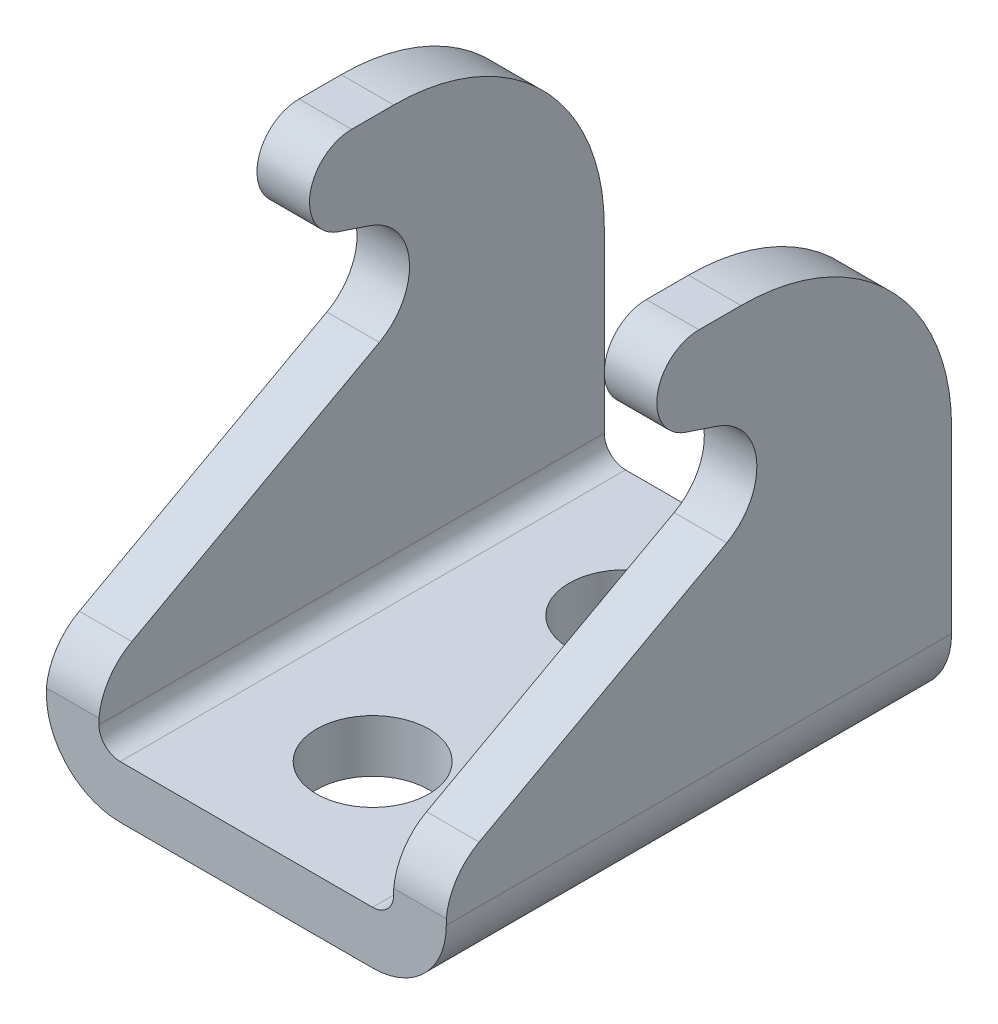
ISO-10303-21;
HEADER;
FILE_DESCRIPTION(('STEP AP214'),'2;1');
FILE_NAME('part.step','',(''),(''),'','','');
FILE_SCHEMA(('AUTOMOTIVE_DESIGN { 1 0 10303 214 1 1 1 1 }'));
ENDSEC;
DATA;
#1=APPLICATION_CONTEXT('core data for automotive mechanical design processes');
#2=APPLICATION_PROTOCOL_DEFINITION('international standard','automotive_design',2000,#1);
#3=PRODUCT_CONTEXT('',#1,'mechanical');
#4=PRODUCT('Part','Part','',(#3));
#5=PRODUCT_RELATED_PRODUCT_CATEGORY('part','',(#4));
#6=PRODUCT_DEFINITION_FORMATION('','',#4);
#7=PRODUCT_DEFINITION_CONTEXT('part definition',#1,'design');
#8=PRODUCT_DEFINITION('design','',#6,#7);
#9=PRODUCT_DEFINITION_SHAPE('','',#8);
#10=(LENGTH_UNIT() NAMED_UNIT(*) SI_UNIT(.MILLI.,.METRE.));
#11=(NAMED_UNIT(*) PLANE_ANGLE_UNIT() SI_UNIT($,.RADIAN.));
#12=(NAMED_UNIT(*) SI_UNIT($,.STERADIAN.) SOLID_ANGLE_UNIT());
#13=UNCERTAINTY_MEASURE_WITH_UNIT(LENGTH_MEASURE(1.E-05),#10,'distance_accuracy_value','');
#14=(GEOMETRIC_REPRESENTATION_CONTEXT(3) GLOBAL_UNCERTAINTY_ASSIGNED_CONTEXT((#13)) GLOBAL_UNIT_ASSIGNED_CONTEXT((#10,
#11,#12)) REPRESENTATION_CONTEXT('',''));
#15=CARTESIAN_POINT('',(0.,0.,0.));
#16=DIRECTION('',(0.,0.,1.));
#17=DIRECTION('',(1.,0.,0.));
#18=AXIS2_PLACEMENT_3D('',#15,#16,#17);
#19=CARTESIAN_POINT('',(15.0749,10.602361807025,83.884239336947));
#20=DIRECTION('',(0.,-0.877525818949163,-0.479529391255219));
#21=DIRECTION('',(0.,0.479529391255219,-0.877525818949163));
#22=AXIS2_PLACEMENT_3D('',#19,#20,#21);
#23=PLANE('',#22);
#24=DIRECTION('',(1.,0.,0.));
#25=VECTOR('',#24,1.);
#26=CARTESIAN_POINT('',(15.0749,20.8042652021749,65.2150319954842));
#27=LINE('',#26,#25);
#28=CARTESIAN_POINT('',(-11.1125,20.8042652021749,65.2150319954842));
#29=VERTEX_POINT('',#28);
#30=CARTESIAN_POINT('',(-15.0749,20.8042652021749,65.2150319954842));
#31=VERTEX_POINT('',#30);
#32=EDGE_CURVE('E211',#29,#31,#27,.F.);
#33=ORIENTED_EDGE('',*,*,#32,.T.);
#34=DIRECTION('',(0.,0.479529391255221,-0.877525818949162));
#35=VECTOR('',#34,1.);
#36=CARTESIAN_POINT('',(-15.0749,10.602361807025,83.884239336947));
#37=LINE('',#36,#35);
#38=CARTESIAN_POINT('',(-15.0749,10.602361807025,83.884239336947));
#39=VERTEX_POINT('',#38);
#40=EDGE_CURVE('E290',#39,#31,#37,.T.);
#41=ORIENTED_EDGE('',*,*,#40,.F.);
#42=DIRECTION('',(1.,0.,0.));
#43=VECTOR('',#42,1.);
#44=CARTESIAN_POINT('',(15.0749,10.602361807025,83.884239336947));
#45=LINE('',#44,#43);
#46=CARTESIAN_POINT('',(-11.1125,10.602361807025,83.884239336947));
#47=VERTEX_POINT('',#46);
#48=EDGE_CURVE('E178',#47,#39,#45,.F.);
#49=ORIENTED_EDGE('',*,*,#48,.F.);
#50=DIRECTION('',(0.,-0.479529391255221,0.877525818949162));
#51=VECTOR('',#50,1.);
#52=CARTESIAN_POINT('',(-11.1125,20.8042652021749,65.2150319954842));
#53=LINE('',#52,#51);
#54=EDGE_CURVE('E298',#29,#47,#53,.T.);
#55=ORIENTED_EDGE('',*,*,#54,.F.);
#56=EDGE_LOOP('',(#33,#41,#49,#55));
#57=FACE_BOUND('',#56,.T.);
#58=ADVANCED_FACE('F16',(#57),#23,.F.);
#59=CARTESIAN_POINT('',(15.0749,24.638,67.31));
#60=DIRECTION('',(1.,0.,0.));
#61=DIRECTION('',(0.,0.,-1.));
#62=AXIS2_PLACEMENT_3D('',#59,#60,#61);
#63=CYLINDRICAL_SURFACE('',#62,4.3688);
#64=DIRECTION('',(1.,0.,0.));
#65=VECTOR('',#64,1.);
#66=CARTESIAN_POINT('',(15.0749,28.7834747603834,65.9310683660803));
#67=LINE('',#66,#65);
#68=CARTESIAN_POINT('',(-11.1125,28.7834747603834,65.9310683660803));
#69=VERTEX_POINT('',#68);
#70=CARTESIAN_POINT('',(-15.0749,28.7834747603834,65.9310683660803));
#71=VERTEX_POINT('',#70);
#72=EDGE_CURVE('E164',#69,#71,#67,.F.);
#73=ORIENTED_EDGE('',*,*,#72,.T.);
#74=CARTESIAN_POINT('',(-15.0749,24.638,67.31));
#75=DIRECTION('',(1.,0.,0.));
#76=DIRECTION('',(0.,0.,-1.));
#77=AXIS2_PLACEMENT_3D('',#74,#75,#76);
#78=CIRCLE('',#77,4.3688);
#79=EDGE_CURVE('E287',#31,#71,#78,.T.);
#80=ORIENTED_EDGE('',*,*,#79,.F.);
#81=ORIENTED_EDGE('',*,*,#32,.F.);
#82=CARTESIAN_POINT('',(-11.1125,24.638,67.31));
#83=DIRECTION('',(1.,0.,0.));
#84=DIRECTION('',(0.,0.,-1.));
#85=AXIS2_PLACEMENT_3D('',#82,#83,#84);
#86=CIRCLE('',#85,4.3688);
#87=EDGE_CURVE('E172',#69,#29,#86,.F.);
#88=ORIENTED_EDGE('',*,*,#87,.F.);
#89=EDGE_LOOP('',(#73,#80,#81,#88));
#90=FACE_BOUND('',#89,.T.);
#91=ADVANCED_FACE('F668',(#90),#63,.F.);
#92=CARTESIAN_POINT('',(15.0749,28.7834747603834,65.9310683660803));
#93=DIRECTION('',(0.,0.94888178913738,-0.315631668632037));
#94=DIRECTION('',(0.,0.315631668632037,0.94888178913738));
#95=AXIS2_PLACEMENT_3D('',#92,#93,#94);
#96=PLANE('',#95);
#97=DIRECTION('',(1.,0.,0.));
#98=VECTOR('',#97,1.);
#99=CARTESIAN_POINT('',(15.0749,29.5755003194888,68.3121305479067));
#100=LINE('',#99,#98);
#101=CARTESIAN_POINT('',(-15.0749,29.5755003194888,68.3121305479067));
#102=VERTEX_POINT('',#101);
#103=CARTESIAN_POINT('',(-11.1125,29.5755003194888,68.3121305479067));
#104=VERTEX_POINT('',#103);
#105=EDGE_CURVE('E154',#102,#104,#100,.T.);
#106=ORIENTED_EDGE('',*,*,#105,.F.);
#107=DIRECTION('',(0.,0.315631668632024,0.948881789137385));
#108=VECTOR('',#107,1.);
#109=CARTESIAN_POINT('',(-15.0749,28.7834747603834,65.9310683660803));
#110=LINE('',#109,#108);
#111=EDGE_CURVE('E286',#71,#102,#110,.T.);
#112=ORIENTED_EDGE('',*,*,#111,.F.);
#113=ORIENTED_EDGE('',*,*,#72,.F.);
#114=DIRECTION('',(0.,-0.315631668632024,-0.948881789137385));
#115=VECTOR('',#114,1.);
#116=CARTESIAN_POINT('',(-11.1125,29.5755003194888,68.3121305479067));
#117=LINE('',#116,#115);
#118=EDGE_CURVE('E167',#104,#69,#117,.T.);
#119=ORIENTED_EDGE('',*,*,#118,.F.);
#120=EDGE_LOOP('',(#106,#112,#113,#119));
#121=FACE_BOUND('',#120,.T.);
#122=ADVANCED_FACE('F168',(#121),#96,.F.);
#123=CARTESIAN_POINT('',(15.0749,32.5882,67.31));
#124=DIRECTION('',(1.,0.,0.));
#125=DIRECTION('',(0.,0.,-1.));
#126=AXIS2_PLACEMENT_3D('',#123,#124,#125);
#127=CYLINDRICAL_SURFACE('',#126,3.175);
#128=CARTESIAN_POINT('',(-15.0749,32.5882,67.31));
#129=DIRECTION('',(1.,0.,0.));
#130=DIRECTION('',(0.,0.,-1.));
#131=AXIS2_PLACEMENT_3D('',#128,#129,#130);
#132=CIRCLE('',#131,3.175);
#133=CARTESIAN_POINT('',(-15.0749,35.7632,67.31));
#134=VERTEX_POINT('',#133);
#135=EDGE_CURVE('E160',#102,#134,#132,.F.);
#136=ORIENTED_EDGE('',*,*,#135,.F.);
#137=ORIENTED_EDGE('',*,*,#105,.T.);
#138=CARTESIAN_POINT('',(-11.1125,32.5882,67.31));
#139=DIRECTION('',(1.,0.,0.));
#140=DIRECTION('',(0.,0.,-1.));
#141=AXIS2_PLACEMENT_3D('',#138,#139,#140);
#142=CIRCLE('',#141,3.175);
#143=CARTESIAN_POINT('',(-11.1125,35.7632,67.31));
#144=VERTEX_POINT('',#143);
#145=EDGE_CURVE('E19',#144,#104,#142,.T.);
#146=ORIENTED_EDGE('',*,*,#145,.F.);
#147=DIRECTION('',(1.,0.,0.));
#148=VECTOR('',#147,1.);
#149=CARTESIAN_POINT('',(-11.1125,35.7632,67.31));
#150=LINE('',#149,#148);
#151=EDGE_CURVE('E149',#134,#144,#150,.T.);
#152=ORIENTED_EDGE('',*,*,#151,.F.);
#153=EDGE_LOOP('',(#136,#137,#146,#152));
#154=FACE_BOUND('',#153,.T.);
#155=ADVANCED_FACE('F156',(#154),#127,.T.);
#156=CARTESIAN_POINT('',(-11.1125,35.7632,86.36));
#157=DIRECTION('',(0.,1.,0.));
#158=DIRECTION('',(0.,0.,1.));
#159=AXIS2_PLACEMENT_3D('',#156,#157,#158);
#160=PLANE('',#159);
#161=ORIENTED_EDGE('',*,*,#151,.T.);
#162=DIRECTION('',(0.,0.,-1.));
#163=VECTOR('',#162,1.);
#164=CARTESIAN_POINT('',(-11.1125,35.7632,86.36));
#165=LINE('',#164,#163);
#166=CARTESIAN_POINT('',(-11.1125,35.7632,64.135));
#167=VERTEX_POINT('',#166);
#168=EDGE_CURVE('E177',#167,#144,#165,.F.);
#169=ORIENTED_EDGE('',*,*,#168,.F.);
#170=DIRECTION('',(1.,0.,0.));
#171=VECTOR('',#170,1.);
#172=CARTESIAN_POINT('',(15.0749,35.7632,64.135));
#173=LINE('',#172,#171);
#174=CARTESIAN_POINT('',(-15.0749,35.7632,64.135));
#175=VERTEX_POINT('',#174);
#176=EDGE_CURVE('E213',#175,#167,#173,.T.);
#177=ORIENTED_EDGE('',*,*,#176,.F.);
#178=DIRECTION('',(0.,0.,1.));
#179=VECTOR('',#178,1.);
#180=CARTESIAN_POINT('',(-15.0749,35.7632,86.36));
#181=LINE('',#180,#179);
#182=EDGE_CURVE('E285',#134,#175,#181,.F.);
#183=ORIENTED_EDGE('',*,*,#182,.F.);
#184=EDGE_LOOP('',(#161,#169,#177,#183));
#185=FACE_BOUND('',#184,.T.);
#186=ADVANCED_FACE('F643',(#185),#160,.T.);
#187=CARTESIAN_POINT('',(15.0749,6.39445,81.5848));
#188=DIRECTION('',(1.,0.,0.));
#189=DIRECTION('',(0.,0.,-1.));
#190=AXIS2_PLACEMENT_3D('',#187,#188,#189);
#191=CYLINDRICAL_SURFACE('',#190,4.79519999999999);
#192=CARTESIAN_POINT('',(-15.0749,6.39445,81.5848));
#193=DIRECTION('',(1.,0.,0.));
#194=DIRECTION('',(0.,0.,-1.));
#195=AXIS2_PLACEMENT_3D('',#192,#193,#194);
#196=CIRCLE('',#195,4.79519999999999);
#197=CARTESIAN_POINT('',(-15.0749,6.83195199999533,86.36));
#198=VERTEX_POINT('',#197);
#199=EDGE_CURVE('E291',#198,#39,#196,.F.);
#200=ORIENTED_EDGE('',*,*,#199,.F.);
#201=DIRECTION('',(1.,0.,0.));
#202=VECTOR('',#201,1.);
#203=CARTESIAN_POINT('',(0.,6.83195199999543,86.36));
#204=LINE('',#203,#202);
#205=CARTESIAN_POINT('',(-11.1125,6.83195199999533,86.36));
#206=VERTEX_POINT('',#205);
#207=EDGE_CURVE('E204',#206,#198,#204,.F.);
#208=ORIENTED_EDGE('',*,*,#207,.F.);
#209=CARTESIAN_POINT('',(-11.1125,6.39445,81.5848));
#210=DIRECTION('',(1.,0.,0.));
#211=DIRECTION('',(0.,0.,-1.));
#212=AXIS2_PLACEMENT_3D('',#209,#210,#211);
#213=CIRCLE('',#212,4.79519999999999);
#214=EDGE_CURVE('E186',#47,#206,#213,.T.);
#215=ORIENTED_EDGE('',*,*,#214,.F.);
#216=ORIENTED_EDGE('',*,*,#48,.T.);
#217=EDGE_LOOP('',(#200,#208,#215,#216));
#218=FACE_BOUND('',#217,.T.);
#219=ADVANCED_FACE('F407',(#218),#191,.T.);
#220=CARTESIAN_POINT('',(0.,0.838199999999993,57.785));
#221=DIRECTION('',(0.,-1.,0.));
#222=DIRECTION('',(0.,0.,-1.));
#223=AXIS2_PLACEMENT_3D('',#220,#221,#222);
#224=CYLINDRICAL_SURFACE('',#223,4.2418);
#225=CARTESIAN_POINT('',(0.,4.8006,57.785));
#226=DIRECTION('',(0.,-1.,0.));
#227=DIRECTION('',(0.,0.,-1.));
#228=AXIS2_PLACEMENT_3D('',#225,#226,#227);
#229=CIRCLE('',#228,4.2418);
#230=CARTESIAN_POINT('',(0.,4.8006,53.5432));
#231=VERTEX_POINT('',#230);
#232=EDGE_CURVE('E262',#231,#231,#229,.T.);
#233=ORIENTED_EDGE('',*,*,#232,.F.);
#234=EDGE_LOOP('',(#233));
#235=FACE_BOUND('',#234,.T.);
#236=CARTESIAN_POINT('',(0.,0.838199999999993,57.785));
#237=DIRECTION('',(0.,-1.,0.));
#238=DIRECTION('',(0.,0.,-1.));
#239=AXIS2_PLACEMENT_3D('',#236,#237,#238);
#240=CIRCLE('',#239,4.2418);
#241=CARTESIAN_POINT('',(0.,0.838199999999993,53.5432));
#242=VERTEX_POINT('',#241);
#243=EDGE_CURVE('E280',#242,#242,#240,.F.);
#244=ORIENTED_EDGE('',*,*,#243,.F.);
#245=EDGE_LOOP('',(#244));
#246=FACE_BOUND('',#245,.T.);
#247=ADVANCED_FACE('F624',(#235,#246),#224,.F.);
#248=CARTESIAN_POINT('',(0.,0.838199999999993,76.835));
#249=DIRECTION('',(0.,-1.,0.));
#250=DIRECTION('',(0.,0.,-1.));
#251=AXIS2_PLACEMENT_3D('',#248,#249,#250);
#252=CYLINDRICAL_SURFACE('',#251,4.2418);
#253=CARTESIAN_POINT('',(0.,4.8006,76.835));
#254=DIRECTION('',(0.,-1.,0.));
#255=DIRECTION('',(0.,0.,-1.));
#256=AXIS2_PLACEMENT_3D('',#253,#254,#255);
#257=CIRCLE('',#256,4.2418);
#258=CARTESIAN_POINT('',(0.,4.8006,72.5932));
#259=VERTEX_POINT('',#258);
#260=EDGE_CURVE('E191',#259,#259,#257,.T.);
#261=ORIENTED_EDGE('',*,*,#260,.F.);
#262=EDGE_LOOP('',(#261));
#263=FACE_BOUND('',#262,.T.);
#264=CARTESIAN_POINT('',(0.,0.838199999999993,76.835));
#265=DIRECTION('',(0.,-1.,0.));
#266=DIRECTION('',(0.,0.,-1.));
#267=AXIS2_PLACEMENT_3D('',#264,#265,#266);
#268=CIRCLE('',#267,4.2418);
#269=CARTESIAN_POINT('',(0.,0.838199999999993,72.5932));
#270=VERTEX_POINT('',#269);
#271=EDGE_CURVE('E276',#270,#270,#268,.F.);
#272=ORIENTED_EDGE('',*,*,#271,.F.);
#273=EDGE_LOOP('',(#272));
#274=FACE_BOUND('',#273,.T.);
#275=ADVANCED_FACE('F615',(#263,#274),#252,.F.);
#276=CARTESIAN_POINT('',(-9.5123,6.4008,86.36));
#277=DIRECTION('',(0.,0.,1.));
#278=DIRECTION('',(1.,0.,0.));
#279=AXIS2_PLACEMENT_3D('',#276,#277,#278);
#280=CYLINDRICAL_SURFACE('',#279,1.6002);
#281=DIRECTION('',(0.,0.,-1.));
#282=VECTOR('',#281,1.);
#283=CARTESIAN_POINT('',(-11.1125,6.40079999999999,86.36));
#284=LINE('',#283,#282);
#285=CARTESIAN_POINT('',(-11.1125,6.40079999999999,86.36));
#286=VERTEX_POINT('',#285);
#287=CARTESIAN_POINT('',(-11.1125,6.40079999999999,48.26));
#288=VERTEX_POINT('',#287);
#289=EDGE_CURVE('E183',#286,#288,#284,.T.);
#290=ORIENTED_EDGE('',*,*,#289,.F.);
#291=CARTESIAN_POINT('',(-9.5123,6.4008,86.36));
#292=DIRECTION('',(0.,0.,1.));
#293=DIRECTION('',(1.,0.,0.));
#294=AXIS2_PLACEMENT_3D('',#291,#292,#293);
#295=CIRCLE('',#294,1.6002);
#296=CARTESIAN_POINT('',(-9.5123,4.8006,86.36));
#297=VERTEX_POINT('',#296);
#298=EDGE_CURVE('E273',#297,#286,#295,.F.);
#299=ORIENTED_EDGE('',*,*,#298,.F.);
#300=DIRECTION('',(0.,0.,1.));
#301=VECTOR('',#300,1.);
#302=CARTESIAN_POINT('',(-9.5123,4.8006,86.36));
#303=LINE('',#302,#301);
#304=CARTESIAN_POINT('',(-9.5123,4.8006,48.26));
#305=VERTEX_POINT('',#304);
#306=EDGE_CURVE('E187',#305,#297,#303,.T.);
#307=ORIENTED_EDGE('',*,*,#306,.F.);
#308=CARTESIAN_POINT('',(-9.5123,6.4008,48.26));
#309=DIRECTION('',(0.,0.,1.));
#310=DIRECTION('',(1.,0.,0.));
#311=AXIS2_PLACEMENT_3D('',#308,#309,#310);
#312=CIRCLE('',#311,1.6002);
#313=EDGE_CURVE('E245',#305,#288,#312,.F.);
#314=ORIENTED_EDGE('',*,*,#313,.T.);
#315=EDGE_LOOP('',(#290,#299,#307,#314));
#316=FACE_BOUND('',#315,.T.);
#317=ADVANCED_FACE('F401',(#316),#280,.F.);
#318=CARTESIAN_POINT('',(-11.1125,6.40079999999999,86.36));
#319=DIRECTION('',(1.,0.,0.));
#320=DIRECTION('',(0.,0.,-1.));
#321=AXIS2_PLACEMENT_3D('',#318,#319,#320);
#322=PLANE('',#321);
#323=ORIENTED_EDGE('',*,*,#289,.T.);
#324=DIRECTION('',(0.,1.,0.));
#325=VECTOR('',#324,1.);
#326=CARTESIAN_POINT('',(-11.1125,0.838199999999993,48.26));
#327=LINE('',#326,#325);
#328=CARTESIAN_POINT('',(-11.1125,19.8882,48.26));
#329=VERTEX_POINT('',#328);
#330=EDGE_CURVE('E247',#288,#329,#327,.T.);
#331=ORIENTED_EDGE('',*,*,#330,.T.);
#332=CARTESIAN_POINT('',(-11.1125,19.8882,64.135));
#333=DIRECTION('',(1.,0.,0.));
#334=DIRECTION('',(0.,0.,-1.));
#335=AXIS2_PLACEMENT_3D('',#332,#333,#334);
#336=CIRCLE('',#335,15.875);
#337=EDGE_CURVE('E185',#167,#329,#336,.F.);
#338=ORIENTED_EDGE('',*,*,#337,.F.);
#339=ORIENTED_EDGE('',*,*,#168,.T.);
#340=ORIENTED_EDGE('',*,*,#145,.T.);
#341=ORIENTED_EDGE('',*,*,#118,.T.);
#342=ORIENTED_EDGE('',*,*,#87,.T.);
#343=ORIENTED_EDGE('',*,*,#54,.T.);
#344=ORIENTED_EDGE('',*,*,#214,.T.);
#345=DIRECTION('',(0.,1.,0.));
#346=VECTOR('',#345,1.);
#347=CARTESIAN_POINT('',(-11.1125,0.838199999999993,86.36));
#348=LINE('',#347,#346);
#349=EDGE_CURVE('E208',#286,#206,#348,.T.);
#350=ORIENTED_EDGE('',*,*,#349,.F.);
#351=EDGE_LOOP('',(#323,#331,#338,#339,#340,#341,#342,#343,#344,#350));
#352=FACE_BOUND('',#351,.T.);
#353=ADVANCED_FACE('F175',(#352),#322,.T.);
#354=CARTESIAN_POINT('',(15.0749,19.8882,64.135));
#355=DIRECTION('',(1.,0.,0.));
#356=DIRECTION('',(0.,0.,-1.));
#357=AXIS2_PLACEMENT_3D('',#354,#355,#356);
#358=CYLINDRICAL_SURFACE('',#357,15.875);
#359=CARTESIAN_POINT('',(-15.0749,19.8882,64.135));
#360=DIRECTION('',(1.,0.,0.));
#361=DIRECTION('',(0.,0.,-1.));
#362=AXIS2_PLACEMENT_3D('',#359,#360,#361);
#363=CIRCLE('',#362,15.875);
#364=CARTESIAN_POINT('',(-15.0749,19.8882,48.26));
#365=VERTEX_POINT('',#364);
#366=EDGE_CURVE('E216',#175,#365,#363,.F.);
#367=ORIENTED_EDGE('',*,*,#366,.F.);
#368=ORIENTED_EDGE('',*,*,#176,.T.);
#369=ORIENTED_EDGE('',*,*,#337,.T.);
#370=DIRECTION('',(1.,0.,0.));
#371=VECTOR('',#370,1.);
#372=CARTESIAN_POINT('',(0.,19.8882,48.26));
#373=LINE('',#372,#371);
#374=EDGE_CURVE('E302',#329,#365,#373,.F.);
#375=ORIENTED_EDGE('',*,*,#374,.T.);
#376=EDGE_LOOP('',(#367,#368,#369,#375));
#377=FACE_BOUND('',#376,.T.);
#378=ADVANCED_FACE('F589',(#377),#358,.T.);
#379=CARTESIAN_POINT('',(-15.0749,35.7632,86.36));
#380=DIRECTION('',(-1.,0.,0.));
#381=DIRECTION('',(0.,0.,1.));
#382=AXIS2_PLACEMENT_3D('',#379,#380,#381);
#383=PLANE('',#382);
#384=ORIENTED_EDGE('',*,*,#135,.T.);
#385=ORIENTED_EDGE('',*,*,#182,.T.);
#386=ORIENTED_EDGE('',*,*,#366,.T.);
#387=DIRECTION('',(0.,1.,0.));
#388=VECTOR('',#387,1.);
#389=CARTESIAN_POINT('',(-15.0749,0.838199999999993,48.26));
#390=LINE('',#389,#388);
#391=CARTESIAN_POINT('',(-15.0749,6.4008,48.26));
#392=VERTEX_POINT('',#391);
#393=EDGE_CURVE('E244',#365,#392,#390,.F.);
#394=ORIENTED_EDGE('',*,*,#393,.T.);
#395=DIRECTION('',(0.,0.,1.));
#396=VECTOR('',#395,1.);
#397=CARTESIAN_POINT('',(-15.0749,6.4008,86.36));
#398=LINE('',#397,#396);
#399=CARTESIAN_POINT('',(-15.0749,6.4008,86.36));
#400=VERTEX_POINT('',#399);
#401=EDGE_CURVE('E283',#400,#392,#398,.F.);
#402=ORIENTED_EDGE('',*,*,#401,.F.);
#403=DIRECTION('',(0.,1.,0.));
#404=VECTOR('',#403,1.);
#405=CARTESIAN_POINT('',(-15.0749,0.838199999999993,86.36));
#406=LINE('',#405,#404);
#407=EDGE_CURVE('E207',#198,#400,#406,.F.);
#408=ORIENTED_EDGE('',*,*,#407,.F.);
#409=ORIENTED_EDGE('',*,*,#199,.T.);
#410=ORIENTED_EDGE('',*,*,#40,.T.);
#411=ORIENTED_EDGE('',*,*,#79,.T.);
#412=ORIENTED_EDGE('',*,*,#111,.T.);
#413=EDGE_LOOP('',(#384,#385,#386,#394,#402,#408,#409,#410,#411,#412));
#414=FACE_BOUND('',#413,.T.);
#415=ADVANCED_FACE('F410',(#414),#383,.T.);
#416=CARTESIAN_POINT('',(-9.5123,6.4008,86.36));
#417=DIRECTION('',(0.,0.,1.));
#418=DIRECTION('',(1.,0.,0.));
#419=AXIS2_PLACEMENT_3D('',#416,#417,#418);
#420=CYLINDRICAL_SURFACE('',#419,5.56260000000001);
#421=CARTESIAN_POINT('',(-9.5123,6.4008,86.36));
#422=DIRECTION('',(0.,0.,1.));
#423=DIRECTION('',(1.,0.,0.));
#424=AXIS2_PLACEMENT_3D('',#421,#422,#423);
#425=CIRCLE('',#424,5.56260000000001);
#426=CARTESIAN_POINT('',(-9.51230000000001,0.838199999999993,86.36));
#427=VERTEX_POINT('',#426);
#428=EDGE_CURVE('E270',#400,#427,#425,.T.);
#429=ORIENTED_EDGE('',*,*,#428,.F.);
#430=ORIENTED_EDGE('',*,*,#401,.T.);
#431=CARTESIAN_POINT('',(-9.5123,6.4008,48.26));
#432=DIRECTION('',(0.,0.,1.));
#433=DIRECTION('',(1.,0.,0.));
#434=AXIS2_PLACEMENT_3D('',#431,#432,#433);
#435=CIRCLE('',#434,5.56260000000001);
#436=CARTESIAN_POINT('',(-9.51230000000001,0.838199999999993,48.26));
#437=VERTEX_POINT('',#436);
#438=EDGE_CURVE('E242',#392,#437,#435,.T.);
#439=ORIENTED_EDGE('',*,*,#438,.T.);
#440=DIRECTION('',(0.,0.,-1.));
#441=VECTOR('',#440,1.);
#442=CARTESIAN_POINT('',(-9.51230000000001,0.838199999999993,86.36));
#443=LINE('',#442,#441);
#444=EDGE_CURVE('E279',#427,#437,#443,.T.);
#445=ORIENTED_EDGE('',*,*,#444,.F.);
#446=EDGE_LOOP('',(#429,#430,#439,#445));
#447=FACE_BOUND('',#446,.T.);
#448=ADVANCED_FACE('F415',(#447),#420,.T.);
#449=CARTESIAN_POINT('',(-9.51230000000001,0.838199999999993,86.36));
#450=DIRECTION('',(0.,-1.,0.));
#451=DIRECTION('',(0.,0.,-1.));
#452=AXIS2_PLACEMENT_3D('',#449,#450,#451);
#453=PLANE('',#452);
#454=DIRECTION('',(1.,0.,0.));
#455=VECTOR('',#454,1.);
#456=CARTESIAN_POINT('',(0.,0.838199999999993,86.36));
#457=LINE('',#456,#455);
#458=CARTESIAN_POINT('',(9.51229999999999,0.838199999999991,86.36));
#459=VERTEX_POINT('',#458);
#460=EDGE_CURVE('E269',#427,#459,#457,.T.);
#461=ORIENTED_EDGE('',*,*,#460,.F.);
#462=ORIENTED_EDGE('',*,*,#444,.T.);
#463=DIRECTION('',(1.,0.,0.));
#464=VECTOR('',#463,1.);
#465=CARTESIAN_POINT('',(0.,0.838199999999993,48.26));
#466=LINE('',#465,#464);
#467=CARTESIAN_POINT('',(9.51229999999999,0.838199999999991,48.26));
#468=VERTEX_POINT('',#467);
#469=EDGE_CURVE('E241',#437,#468,#466,.T.);
#470=ORIENTED_EDGE('',*,*,#469,.T.);
#471=DIRECTION('',(0.,0.,1.));
#472=VECTOR('',#471,1.);
#473=CARTESIAN_POINT('',(9.5123,0.83819999999999,86.36));
#474=LINE('',#473,#472);
#475=EDGE_CURVE('E313',#459,#468,#474,.F.);
#476=ORIENTED_EDGE('',*,*,#475,.F.);
#477=EDGE_LOOP('',(#461,#462,#470,#476));
#478=FACE_BOUND('',#477,.T.);
#479=ORIENTED_EDGE('',*,*,#271,.T.);
#480=EDGE_LOOP('',(#479));
#481=FACE_BOUND('',#480,.T.);
#482=ORIENTED_EDGE('',*,*,#243,.T.);
#483=EDGE_LOOP('',(#482));
#484=FACE_BOUND('',#483,.T.);
#485=ADVANCED_FACE('F419',(#478,#481,#484),#453,.T.);
#486=CARTESIAN_POINT('',(9.51229999999999,6.40079999999999,86.36));
#487=DIRECTION('',(0.,0.,1.));
#488=DIRECTION('',(1.,0.,0.));
#489=AXIS2_PLACEMENT_3D('',#486,#487,#488);
#490=CYLINDRICAL_SURFACE('',#489,5.5626);
#491=CARTESIAN_POINT('',(9.51229999999999,6.40079999999999,86.36));
#492=DIRECTION('',(0.,0.,1.));
#493=DIRECTION('',(1.,0.,0.));
#494=AXIS2_PLACEMENT_3D('',#491,#492,#493);
#495=CIRCLE('',#494,5.5626);
#496=CARTESIAN_POINT('',(15.0749,6.40079999999999,86.36));
#497=VERTEX_POINT('',#496);
#498=EDGE_CURVE('E266',#459,#497,#495,.T.);
#499=ORIENTED_EDGE('',*,*,#498,.F.);
#500=ORIENTED_EDGE('',*,*,#475,.T.);
#501=CARTESIAN_POINT('',(9.51229999999999,6.40079999999999,48.26));
#502=DIRECTION('',(0.,0.,1.));
#503=DIRECTION('',(1.,0.,0.));
#504=AXIS2_PLACEMENT_3D('',#501,#502,#503);
#505=CIRCLE('',#504,5.5626);
#506=CARTESIAN_POINT('',(15.0749,6.40079999999999,48.26));
#507=VERTEX_POINT('',#506);
#508=EDGE_CURVE('E238',#468,#507,#505,.T.);
#509=ORIENTED_EDGE('',*,*,#508,.T.);
#510=DIRECTION('',(0.,0.,-1.));
#511=VECTOR('',#510,1.);
#512=CARTESIAN_POINT('',(15.0749,6.40079999999999,86.36));
#513=LINE('',#512,#511);
#514=EDGE_CURVE('E316',#497,#507,#513,.T.);
#515=ORIENTED_EDGE('',*,*,#514,.F.);
#516=EDGE_LOOP('',(#499,#500,#509,#515));
#517=FACE_BOUND('',#516,.T.);
#518=ADVANCED_FACE('F424',(#517),#490,.T.);
#519=CARTESIAN_POINT('',(15.0749,6.40079999999999,86.36));
#520=DIRECTION('',(1.,0.,0.));
#521=DIRECTION('',(0.,0.,-1.));
#522=AXIS2_PLACEMENT_3D('',#519,#520,#521);
#523=PLANE('',#522);
#524=CARTESIAN_POINT('',(15.0749,24.638,67.31));
#525=DIRECTION('',(1.,0.,0.));
#526=DIRECTION('',(0.,0.,-1.));
#527=AXIS2_PLACEMENT_3D('',#524,#525,#526);
#528=CIRCLE('',#527,4.3688);
#529=CARTESIAN_POINT('',(15.0749,28.7834747603834,65.9310683660803));
#530=VERTEX_POINT('',#529);
#531=CARTESIAN_POINT('',(15.0749,20.8042652021749,65.2150319954842));
#532=VERTEX_POINT('',#531);
#533=EDGE_CURVE('E255',#530,#532,#528,.F.);
#534=ORIENTED_EDGE('',*,*,#533,.T.);
#535=DIRECTION('',(0.,0.479529391255219,-0.877525818949163));
#536=VECTOR('',#535,1.);
#537=CARTESIAN_POINT('',(15.0749,10.602361807025,83.884239336947));
#538=LINE('',#537,#536);
#539=CARTESIAN_POINT('',(15.0749,10.602361807025,83.884239336947));
#540=VERTEX_POINT('',#539);
#541=EDGE_CURVE('E200',#532,#540,#538,.F.);
#542=ORIENTED_EDGE('',*,*,#541,.T.);
#543=CARTESIAN_POINT('',(15.0749,6.39445,81.5848));
#544=DIRECTION('',(1.,0.,0.));
#545=DIRECTION('',(0.,0.,-1.));
#546=AXIS2_PLACEMENT_3D('',#543,#544,#545);
#547=CIRCLE('',#546,4.79519999999999);
#548=CARTESIAN_POINT('',(15.0749,6.83195199999533,86.36));
#549=VERTEX_POINT('',#548);
#550=EDGE_CURVE('E203',#549,#540,#547,.F.);
#551=ORIENTED_EDGE('',*,*,#550,.F.);
#552=DIRECTION('',(0.,1.,0.));
#553=VECTOR('',#552,1.);
#554=CARTESIAN_POINT('',(15.0749,0.838199999999993,86.36));
#555=LINE('',#554,#553);
#556=EDGE_CURVE('E265',#497,#549,#555,.T.);
#557=ORIENTED_EDGE('',*,*,#556,.F.);
#558=ORIENTED_EDGE('',*,*,#514,.T.);
#559=DIRECTION('',(0.,1.,0.));
#560=VECTOR('',#559,1.);
#561=CARTESIAN_POINT('',(15.0749,0.838199999999993,48.26));
#562=LINE('',#561,#560);
#563=CARTESIAN_POINT('',(15.0749,19.8882,48.26));
#564=VERTEX_POINT('',#563);
#565=EDGE_CURVE('E240',#507,#564,#562,.T.);
#566=ORIENTED_EDGE('',*,*,#565,.T.);
#567=CARTESIAN_POINT('',(15.0749,19.8882,64.135));
#568=DIRECTION('',(1.,0.,0.));
#569=DIRECTION('',(0.,0.,-1.));
#570=AXIS2_PLACEMENT_3D('',#567,#568,#569);
#571=CIRCLE('',#570,15.875);
#572=CARTESIAN_POINT('',(15.0749,35.7632,64.135));
#573=VERTEX_POINT('',#572);
#574=EDGE_CURVE('E249',#573,#564,#571,.F.);
#575=ORIENTED_EDGE('',*,*,#574,.F.);
#576=DIRECTION('',(0.,0.,1.));
#577=VECTOR('',#576,1.);
#578=CARTESIAN_POINT('',(15.0749,35.7632,86.36));
#579=LINE('',#578,#577);
#580=CARTESIAN_POINT('',(15.0749,35.7632,67.31));
#581=VERTEX_POINT('',#580);
#582=EDGE_CURVE('E192',#581,#573,#579,.F.);
#583=ORIENTED_EDGE('',*,*,#582,.F.);
#584=CARTESIAN_POINT('',(15.0749,32.5882,67.31));
#585=DIRECTION('',(1.,0.,0.));
#586=DIRECTION('',(0.,0.,-1.));
#587=AXIS2_PLACEMENT_3D('',#584,#585,#586);
#588=CIRCLE('',#587,3.175);
#589=CARTESIAN_POINT('',(15.0749,29.5755003194888,68.3121305479067));
#590=VERTEX_POINT('',#589);
#591=EDGE_CURVE('E252',#590,#581,#588,.F.);
#592=ORIENTED_EDGE('',*,*,#591,.F.);
#593=DIRECTION('',(0.,0.315631668632037,0.94888178913738));
#594=VECTOR('',#593,1.);
#595=CARTESIAN_POINT('',(15.0749,28.7834747603834,65.9310683660803));
#596=LINE('',#595,#594);
#597=EDGE_CURVE('E196',#590,#530,#596,.F.);
#598=ORIENTED_EDGE('',*,*,#597,.T.);
#599=EDGE_LOOP('',(#534,#542,#551,#557,#558,#566,#575,#583,#592,#598));
#600=FACE_BOUND('',#599,.T.);
#601=ADVANCED_FACE('F428',(#600),#523,.T.);
#602=CARTESIAN_POINT('',(0.,0.838199999999993,86.36));
#603=DIRECTION('',(0.,0.,1.));
#604=DIRECTION('',(1.,0.,0.));
#605=AXIS2_PLACEMENT_3D('',#602,#603,#604);
#606=PLANE('',#605);
#607=ORIENTED_EDGE('',*,*,#498,.T.);
#608=ORIENTED_EDGE('',*,*,#556,.T.);
#609=DIRECTION('',(1.,0.,0.));
#610=VECTOR('',#609,1.);
#611=CARTESIAN_POINT('',(15.0749,6.83195199999543,86.36));
#612=LINE('',#611,#610);
#613=CARTESIAN_POINT('',(11.1125,6.83195199999533,86.36));
#614=VERTEX_POINT('',#613);
#615=EDGE_CURVE('E259',#614,#549,#612,.T.);
#616=ORIENTED_EDGE('',*,*,#615,.F.);
#617=DIRECTION('',(0.,1.,0.));
#618=VECTOR('',#617,1.);
#619=CARTESIAN_POINT('',(11.1125,0.838199999999993,86.36));
#620=LINE('',#619,#618);
#621=CARTESIAN_POINT('',(11.1125,6.40079999999999,86.36));
#622=VERTEX_POINT('',#621);
#623=EDGE_CURVE('E34',#614,#622,#620,.F.);
#624=ORIENTED_EDGE('',*,*,#623,.T.);
#625=CARTESIAN_POINT('',(9.5123,6.40079999999999,86.36));
#626=DIRECTION('',(0.,0.,1.));
#627=DIRECTION('',(1.,0.,0.));
#628=AXIS2_PLACEMENT_3D('',#625,#626,#627);
#629=CIRCLE('',#628,1.6002);
#630=CARTESIAN_POINT('',(9.5123,4.80059999999999,86.36));
#631=VERTEX_POINT('',#630);
#632=EDGE_CURVE('E235',#622,#631,#629,.F.);
#633=ORIENTED_EDGE('',*,*,#632,.T.);
#634=DIRECTION('',(1.,0.,0.));
#635=VECTOR('',#634,1.);
#636=CARTESIAN_POINT('',(9.5123,4.8006,86.36));
#637=LINE('',#636,#635);
#638=EDGE_CURVE('E190',#297,#631,#637,.T.);
#639=ORIENTED_EDGE('',*,*,#638,.F.);
#640=ORIENTED_EDGE('',*,*,#298,.T.);
#641=ORIENTED_EDGE('',*,*,#349,.T.);
#642=ORIENTED_EDGE('',*,*,#207,.T.);
#643=ORIENTED_EDGE('',*,*,#407,.T.);
#644=ORIENTED_EDGE('',*,*,#428,.T.);
#645=ORIENTED_EDGE('',*,*,#460,.T.);
#646=EDGE_LOOP('',(#607,#608,#616,#624,#633,#639,#640,#641,#642,#643,#644,#645));
#647=FACE_BOUND('',#646,.T.);
#648=ADVANCED_FACE('F399',(#647),#606,.T.);
#649=CARTESIAN_POINT('',(9.5123,4.8006,86.36));
#650=DIRECTION('',(0.,1.,0.));
#651=DIRECTION('',(0.,0.,1.));
#652=AXIS2_PLACEMENT_3D('',#649,#650,#651);
#653=PLANE('',#652);
#654=ORIENTED_EDGE('',*,*,#638,.T.);
#655=DIRECTION('',(0.,0.,1.));
#656=VECTOR('',#655,1.);
#657=CARTESIAN_POINT('',(9.5123,4.80059999999999,86.36));
#658=LINE('',#657,#656);
#659=CARTESIAN_POINT('',(9.5123,4.80059999999999,48.26));
#660=VERTEX_POINT('',#659);
#661=EDGE_CURVE('E234',#631,#660,#658,.F.);
#662=ORIENTED_EDGE('',*,*,#661,.T.);
#663=DIRECTION('',(1.,0.,0.));
#664=VECTOR('',#663,1.);
#665=CARTESIAN_POINT('',(0.,4.8006,48.26));
#666=LINE('',#665,#664);
#667=EDGE_CURVE('E248',#660,#305,#666,.F.);
#668=ORIENTED_EDGE('',*,*,#667,.T.);
#669=ORIENTED_EDGE('',*,*,#306,.T.);
#670=EDGE_LOOP('',(#654,#662,#668,#669));
#671=FACE_BOUND('',#670,.T.);
#672=ORIENTED_EDGE('',*,*,#260,.T.);
#673=EDGE_LOOP('',(#672));
#674=FACE_BOUND('',#673,.T.);
#675=ORIENTED_EDGE('',*,*,#232,.T.);
#676=EDGE_LOOP('',(#675));
#677=FACE_BOUND('',#676,.T.);
#678=ADVANCED_FACE('F392',(#671,#674,#677),#653,.T.);
#679=CARTESIAN_POINT('',(15.0749,6.39445,81.5848));
#680=DIRECTION('',(1.,0.,0.));
#681=DIRECTION('',(0.,0.,-1.));
#682=AXIS2_PLACEMENT_3D('',#679,#680,#681);
#683=CYLINDRICAL_SURFACE('',#682,4.79519999999999);
#684=ORIENTED_EDGE('',*,*,#550,.T.);
#685=DIRECTION('',(1.,0.,0.));
#686=VECTOR('',#685,1.);
#687=CARTESIAN_POINT('',(15.0749,10.602361807025,83.884239336947));
#688=LINE('',#687,#686);
#689=CARTESIAN_POINT('',(11.1125,10.602361807025,83.884239336947));
#690=VERTEX_POINT('',#689);
#691=EDGE_CURVE('E202',#540,#690,#688,.F.);
#692=ORIENTED_EDGE('',*,*,#691,.T.);
#693=CARTESIAN_POINT('',(11.1125,6.39445,81.5848));
#694=DIRECTION('',(1.,0.,0.));
#695=DIRECTION('',(0.,0.,-1.));
#696=AXIS2_PLACEMENT_3D('',#693,#694,#695);
#697=CIRCLE('',#696,4.79519999999999);
#698=EDGE_CURVE('E229',#614,#690,#697,.F.);
#699=ORIENTED_EDGE('',*,*,#698,.F.);
#700=ORIENTED_EDGE('',*,*,#615,.T.);
#701=EDGE_LOOP('',(#684,#692,#699,#700));
#702=FACE_BOUND('',#701,.T.);
#703=ADVANCED_FACE('F431',(#702),#683,.T.);
#704=CARTESIAN_POINT('',(15.0749,10.602361807025,83.884239336947));
#705=DIRECTION('',(0.,-0.877525818949163,-0.479529391255219));
#706=DIRECTION('',(0.,0.479529391255219,-0.877525818949163));
#707=AXIS2_PLACEMENT_3D('',#704,#705,#706);
#708=PLANE('',#707);
#709=ORIENTED_EDGE('',*,*,#691,.F.);
#710=ORIENTED_EDGE('',*,*,#541,.F.);
#711=DIRECTION('',(1.,0.,0.));
#712=VECTOR('',#711,1.);
#713=CARTESIAN_POINT('',(15.0749,20.8042652021749,65.2150319954842));
#714=LINE('',#713,#712);
#715=CARTESIAN_POINT('',(11.1125,20.8042652021749,65.2150319954842));
#716=VERTEX_POINT('',#715);
#717=EDGE_CURVE('E199',#532,#716,#714,.F.);
#718=ORIENTED_EDGE('',*,*,#717,.T.);
#719=DIRECTION('',(0.,0.479529391255221,-0.877525818949162));
#720=VECTOR('',#719,1.);
#721=CARTESIAN_POINT('',(11.1125,10.602361807025,83.884239336947));
#722=LINE('',#721,#720);
#723=EDGE_CURVE('E228',#690,#716,#722,.T.);
#724=ORIENTED_EDGE('',*,*,#723,.F.);
#725=EDGE_LOOP('',(#709,#710,#718,#724));
#726=FACE_BOUND('',#725,.T.);
#727=ADVANCED_FACE('F436',(#726),#708,.F.);
#728=CARTESIAN_POINT('',(15.0749,24.638,67.31));
#729=DIRECTION('',(1.,0.,0.));
#730=DIRECTION('',(0.,0.,-1.));
#731=AXIS2_PLACEMENT_3D('',#728,#729,#730);
#732=CYLINDRICAL_SURFACE('',#731,4.3688);
#733=ORIENTED_EDGE('',*,*,#717,.F.);
#734=ORIENTED_EDGE('',*,*,#533,.F.);
#735=DIRECTION('',(1.,0.,0.));
#736=VECTOR('',#735,1.);
#737=CARTESIAN_POINT('',(15.0749,28.7834747603834,65.9310683660803));
#738=LINE('',#737,#736);
#739=CARTESIAN_POINT('',(11.1125,28.7834747603834,65.9310683660803));
#740=VERTEX_POINT('',#739);
#741=EDGE_CURVE('E198',#530,#740,#738,.F.);
#742=ORIENTED_EDGE('',*,*,#741,.T.);
#743=CARTESIAN_POINT('',(11.1125,24.638,67.31));
#744=DIRECTION('',(1.,0.,0.));
#745=DIRECTION('',(0.,0.,-1.));
#746=AXIS2_PLACEMENT_3D('',#743,#744,#745);
#747=CIRCLE('',#746,4.3688);
#748=EDGE_CURVE('E225',#716,#740,#747,.T.);
#749=ORIENTED_EDGE('',*,*,#748,.F.);
#750=EDGE_LOOP('',(#733,#734,#742,#749));
#751=FACE_BOUND('',#750,.T.);
#752=ADVANCED_FACE('F441',(#751),#732,.F.);
#753=CARTESIAN_POINT('',(15.0749,28.7834747603834,65.9310683660803));
#754=DIRECTION('',(0.,0.94888178913738,-0.315631668632037));
#755=DIRECTION('',(0.,0.315631668632037,0.94888178913738));
#756=AXIS2_PLACEMENT_3D('',#753,#754,#755);
#757=PLANE('',#756);
#758=ORIENTED_EDGE('',*,*,#741,.F.);
#759=ORIENTED_EDGE('',*,*,#597,.F.);
#760=DIRECTION('',(1.,0.,0.));
#761=VECTOR('',#760,1.);
#762=CARTESIAN_POINT('',(15.0749,29.5755003194888,68.3121305479067));
#763=LINE('',#762,#761);
#764=CARTESIAN_POINT('',(11.1125,29.5755003194888,68.3121305479067));
#765=VERTEX_POINT('',#764);
#766=EDGE_CURVE('E254',#765,#590,#763,.T.);
#767=ORIENTED_EDGE('',*,*,#766,.F.);
#768=DIRECTION('',(0.,0.315631668632024,0.948881789137385));
#769=VECTOR('',#768,1.);
#770=CARTESIAN_POINT('',(11.1125,28.7834747603834,65.9310683660803));
#771=LINE('',#770,#769);
#772=EDGE_CURVE('E224',#740,#765,#771,.T.);
#773=ORIENTED_EDGE('',*,*,#772,.F.);
#774=EDGE_LOOP('',(#758,#759,#767,#773));
#775=FACE_BOUND('',#774,.T.);
#776=ADVANCED_FACE('F445',(#775),#757,.F.);
#777=CARTESIAN_POINT('',(15.0749,32.5882,67.31));
#778=DIRECTION('',(1.,0.,0.));
#779=DIRECTION('',(0.,0.,-1.));
#780=AXIS2_PLACEMENT_3D('',#777,#778,#779);
#781=CYLINDRICAL_SURFACE('',#780,3.175);
#782=ORIENTED_EDGE('',*,*,#591,.T.);
#783=DIRECTION('',(1.,0.,0.));
#784=VECTOR('',#783,1.);
#785=CARTESIAN_POINT('',(15.0749,35.7632,67.31));
#786=LINE('',#785,#784);
#787=CARTESIAN_POINT('',(11.1125,35.7632,67.31));
#788=VERTEX_POINT('',#787);
#789=EDGE_CURVE('E195',#788,#581,#786,.T.);
#790=ORIENTED_EDGE('',*,*,#789,.F.);
#791=CARTESIAN_POINT('',(11.1125,32.5882,67.31));
#792=DIRECTION('',(1.,0.,0.));
#793=DIRECTION('',(0.,0.,-1.));
#794=AXIS2_PLACEMENT_3D('',#791,#792,#793);
#795=CIRCLE('',#794,3.175);
#796=EDGE_CURVE('E221',#765,#788,#795,.F.);
#797=ORIENTED_EDGE('',*,*,#796,.F.);
#798=ORIENTED_EDGE('',*,*,#766,.T.);
#799=EDGE_LOOP('',(#782,#790,#797,#798));
#800=FACE_BOUND('',#799,.T.);
#801=ADVANCED_FACE('F449',(#800),#781,.T.);
#802=CARTESIAN_POINT('',(15.0749,35.7632,86.36));
#803=DIRECTION('',(0.,1.,0.));
#804=DIRECTION('',(0.,0.,1.));
#805=AXIS2_PLACEMENT_3D('',#802,#803,#804);
#806=PLANE('',#805);
#807=DIRECTION('',(1.,0.,0.));
#808=VECTOR('',#807,1.);
#809=CARTESIAN_POINT('',(15.0749,35.7632,64.135));
#810=LINE('',#809,#808);
#811=CARTESIAN_POINT('',(11.1125,35.7632,64.135));
#812=VERTEX_POINT('',#811);
#813=EDGE_CURVE('E194',#812,#573,#810,.T.);
#814=ORIENTED_EDGE('',*,*,#813,.F.);
#815=DIRECTION('',(0.,0.,1.));
#816=VECTOR('',#815,1.);
#817=CARTESIAN_POINT('',(11.1125,35.7632,86.36));
#818=LINE('',#817,#816);
#819=EDGE_CURVE('E220',#788,#812,#818,.F.);
#820=ORIENTED_EDGE('',*,*,#819,.F.);
#821=ORIENTED_EDGE('',*,*,#789,.T.);
#822=ORIENTED_EDGE('',*,*,#582,.T.);
#823=EDGE_LOOP('',(#814,#820,#821,#822));
#824=FACE_BOUND('',#823,.T.);
#825=ADVANCED_FACE('F453',(#824),#806,.T.);
#826=CARTESIAN_POINT('',(15.0749,19.8882,64.135));
#827=DIRECTION('',(1.,0.,0.));
#828=DIRECTION('',(0.,0.,-1.));
#829=AXIS2_PLACEMENT_3D('',#826,#827,#828);
#830=CYLINDRICAL_SURFACE('',#829,15.875);
#831=ORIENTED_EDGE('',*,*,#574,.T.);
#832=DIRECTION('',(1.,0.,0.));
#833=VECTOR('',#832,1.);
#834=CARTESIAN_POINT('',(0.,19.8882,48.26));
#835=LINE('',#834,#833);
#836=CARTESIAN_POINT('',(11.1125,19.8882,48.26));
#837=VERTEX_POINT('',#836);
#838=EDGE_CURVE('E237',#564,#837,#835,.F.);
#839=ORIENTED_EDGE('',*,*,#838,.T.);
#840=CARTESIAN_POINT('',(11.1125,19.8882,64.135));
#841=DIRECTION('',(1.,0.,0.));
#842=DIRECTION('',(0.,0.,-1.));
#843=AXIS2_PLACEMENT_3D('',#840,#841,#842);
#844=CIRCLE('',#843,15.875);
#845=EDGE_CURVE('E217',#812,#837,#844,.F.);
#846=ORIENTED_EDGE('',*,*,#845,.F.);
#847=ORIENTED_EDGE('',*,*,#813,.T.);
#848=EDGE_LOOP('',(#831,#839,#846,#847));
#849=FACE_BOUND('',#848,.T.);
#850=ADVANCED_FACE('F455',(#849),#830,.T.);
#851=CARTESIAN_POINT('',(0.,0.838199999999993,48.26));
#852=DIRECTION('',(0.,0.,1.));
#853=DIRECTION('',(1.,0.,0.));
#854=AXIS2_PLACEMENT_3D('',#851,#852,#853);
#855=PLANE('',#854);
#856=ORIENTED_EDGE('',*,*,#565,.F.);
#857=ORIENTED_EDGE('',*,*,#508,.F.);
#858=ORIENTED_EDGE('',*,*,#469,.F.);
#859=ORIENTED_EDGE('',*,*,#438,.F.);
#860=ORIENTED_EDGE('',*,*,#393,.F.);
#861=ORIENTED_EDGE('',*,*,#374,.F.);
#862=ORIENTED_EDGE('',*,*,#330,.F.);
#863=ORIENTED_EDGE('',*,*,#313,.F.);
#864=ORIENTED_EDGE('',*,*,#667,.F.);
#865=CARTESIAN_POINT('',(9.5123,6.40079999999999,48.26));
#866=DIRECTION('',(0.,0.,1.));
#867=DIRECTION('',(1.,0.,0.));
#868=AXIS2_PLACEMENT_3D('',#865,#866,#867);
#869=CIRCLE('',#868,1.6002);
#870=CARTESIAN_POINT('',(11.1125,6.40079999999999,48.26));
#871=VERTEX_POINT('',#870);
#872=EDGE_CURVE('E232',#660,#871,#869,.T.);
#873=ORIENTED_EDGE('',*,*,#872,.T.);
#874=DIRECTION('',(0.,1.,0.));
#875=VECTOR('',#874,1.);
#876=CARTESIAN_POINT('',(11.1125,35.7632,48.26));
#877=LINE('',#876,#875);
#878=EDGE_CURVE('E25',#837,#871,#877,.F.);
#879=ORIENTED_EDGE('',*,*,#878,.F.);
#880=ORIENTED_EDGE('',*,*,#838,.F.);
#881=EDGE_LOOP('',(#856,#857,#858,#859,#860,#861,#862,#863,#864,#873,#879,#880));
#882=FACE_BOUND('',#881,.T.);
#883=ADVANCED_FACE('F368',(#882),#855,.F.);
#884=CARTESIAN_POINT('',(9.5123,6.40079999999999,86.36));
#885=DIRECTION('',(0.,0.,1.));
#886=DIRECTION('',(1.,0.,0.));
#887=AXIS2_PLACEMENT_3D('',#884,#885,#886);
#888=CYLINDRICAL_SURFACE('',#887,1.6002);
#889=ORIENTED_EDGE('',*,*,#661,.F.);
#890=ORIENTED_EDGE('',*,*,#632,.F.);
#891=DIRECTION('',(0.,0.,1.));
#892=VECTOR('',#891,1.);
#893=CARTESIAN_POINT('',(11.1125,6.40079999999999,86.36));
#894=LINE('',#893,#892);
#895=EDGE_CURVE('E11',#871,#622,#894,.T.);
#896=ORIENTED_EDGE('',*,*,#895,.F.);
#897=ORIENTED_EDGE('',*,*,#872,.F.);
#898=EDGE_LOOP('',(#889,#890,#896,#897));
#899=FACE_BOUND('',#898,.T.);
#900=ADVANCED_FACE('F398',(#899),#888,.F.);
#901=CARTESIAN_POINT('',(11.1125,35.7632,86.36));
#902=DIRECTION('',(-1.,0.,0.));
#903=DIRECTION('',(0.,0.,1.));
#904=AXIS2_PLACEMENT_3D('',#901,#902,#903);
#905=PLANE('',#904);
#906=ORIENTED_EDGE('',*,*,#895,.T.);
#907=ORIENTED_EDGE('',*,*,#623,.F.);
#908=ORIENTED_EDGE('',*,*,#698,.T.);
#909=ORIENTED_EDGE('',*,*,#723,.T.);
#910=ORIENTED_EDGE('',*,*,#748,.T.);
#911=ORIENTED_EDGE('',*,*,#772,.T.);
#912=ORIENTED_EDGE('',*,*,#796,.T.);
#913=ORIENTED_EDGE('',*,*,#819,.T.);
#914=ORIENTED_EDGE('',*,*,#845,.T.);
#915=ORIENTED_EDGE('',*,*,#878,.T.);
#916=EDGE_LOOP('',(#906,#907,#908,#909,#910,#911,#912,#913,#914,#915));
#917=FACE_BOUND('',#916,.T.);
#918=ADVANCED_FACE('F362',(#917),#905,.T.);
#919=CLOSED_SHELL('',(#58,#91,#122,#155,#186,#219,#247,#275,#317,#353,#378,#415,#448,#485,#518,
#601,#648,#678,#703,#727,#752,#776,#801,#825,#850,#883,#900,#918));
#920=MANIFOLD_SOLID_BREP('B1',#919);
#921=ADVANCED_BREP_SHAPE_REPRESENTATION('',(#18,#920),#14);
#922=SHAPE_DEFINITION_REPRESENTATION(#9,#921);
ENDSEC;
END-ISO-10303-21;
